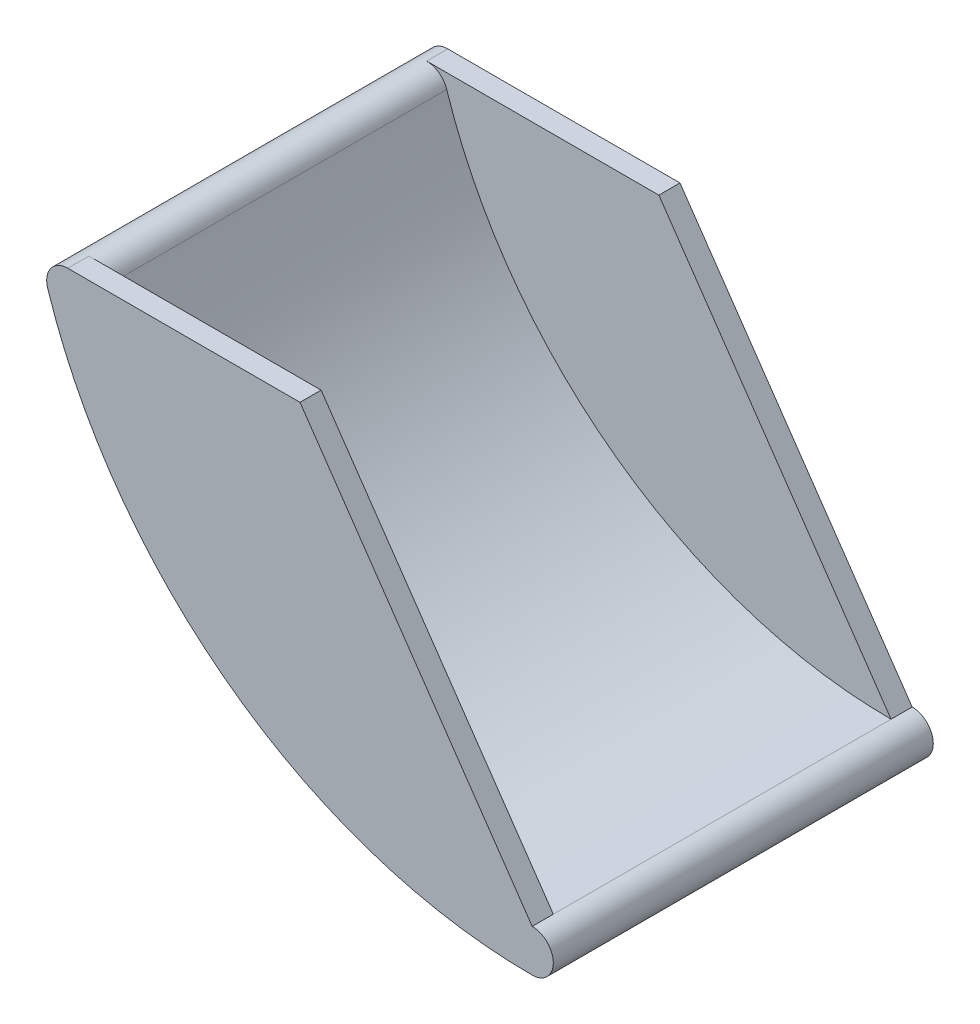
ISO-10303-21;
HEADER;
FILE_DESCRIPTION(('STEP AP214'),'2;1');
FILE_NAME('part.step','',(''),(''),'','','');
FILE_SCHEMA(('AUTOMOTIVE_DESIGN { 1 0 10303 214 1 1 1 1 }'));
ENDSEC;
DATA;
#1=APPLICATION_CONTEXT('core data for automotive mechanical design processes');
#2=APPLICATION_PROTOCOL_DEFINITION('international standard','automotive_design',2000,#1);
#3=PRODUCT_CONTEXT('',#1,'mechanical');
#4=PRODUCT('Part','Part','',(#3));
#5=PRODUCT_RELATED_PRODUCT_CATEGORY('part','',(#4));
#6=PRODUCT_DEFINITION_FORMATION('','',#4);
#7=PRODUCT_DEFINITION_CONTEXT('part definition',#1,'design');
#8=PRODUCT_DEFINITION('design','',#6,#7);
#9=PRODUCT_DEFINITION_SHAPE('','',#8);
#10=(LENGTH_UNIT() NAMED_UNIT(*) SI_UNIT(.MILLI.,.METRE.));
#11=(NAMED_UNIT(*) PLANE_ANGLE_UNIT() SI_UNIT($,.RADIAN.));
#12=(NAMED_UNIT(*) SI_UNIT($,.STERADIAN.) SOLID_ANGLE_UNIT());
#13=UNCERTAINTY_MEASURE_WITH_UNIT(LENGTH_MEASURE(1.E-05),#10,'distance_accuracy_value','');
#14=(GEOMETRIC_REPRESENTATION_CONTEXT(3) GLOBAL_UNCERTAINTY_ASSIGNED_CONTEXT((#13)) GLOBAL_UNIT_ASSIGNED_CONTEXT((#10,
#11,#12)) REPRESENTATION_CONTEXT('',''));
#15=CARTESIAN_POINT('',(0.,0.,0.));
#16=DIRECTION('',(0.,0.,1.));
#17=DIRECTION('',(1.,0.,0.));
#18=AXIS2_PLACEMENT_3D('',#15,#16,#17);
#19=CARTESIAN_POINT('',(219.999982950901,231.249976557489,90.));
#20=DIRECTION('',(0.,0.,-1.));
#21=DIRECTION('',(-1.,0.,0.));
#22=AXIS2_PLACEMENT_3D('',#19,#20,#21);
#23=CYLINDRICAL_SURFACE('',#22,221.249976557489);
#24=DIRECTION('',(0.,0.,-1.));
#25=VECTOR('',#24,1.);
#26=CARTESIAN_POINT('',(219.999999262742,10.0000000000006,90.));
#27=LINE('',#26,#25);
#28=CARTESIAN_POINT('',(219.999999262742,10.0000000000006,80.));
#29=VERTEX_POINT('',#28);
#30=CARTESIAN_POINT('',(219.999999262742,10.0000000000006,-80.));
#31=VERTEX_POINT('',#30);
#32=EDGE_CURVE('E178',#29,#31,#27,.T.);
#33=ORIENTED_EDGE('',*,*,#32,.T.);
#34=CARTESIAN_POINT('',(219.999982950901,231.249976557489,-80.));
#35=DIRECTION('',(0.,0.,1.));
#36=DIRECTION('',(1.,0.,0.));
#37=AXIS2_PLACEMENT_3D('',#34,#35,#36);
#38=CIRCLE('',#37,221.249976557489);
#39=CARTESIAN_POINT('',(9.51351374066933,163.081080379689,-79.9999999999999));
#40=VERTEX_POINT('',#39);
#41=EDGE_CURVE('E136',#40,#31,#38,.T.);
#42=ORIENTED_EDGE('',*,*,#41,.F.);
#43=DIRECTION('',(0.,0.,-1.));
#44=VECTOR('',#43,1.);
#45=CARTESIAN_POINT('',(9.51351374066933,163.081080379689,90.));
#46=LINE('',#45,#44);
#47=CARTESIAN_POINT('',(9.51351374066916,163.081080379689,80.));
#48=VERTEX_POINT('',#47);
#49=EDGE_CURVE('E175',#48,#40,#46,.T.);
#50=ORIENTED_EDGE('',*,*,#49,.F.);
#51=CARTESIAN_POINT('',(219.999982950901,231.249976557489,80.));
#52=DIRECTION('',(0.,0.,1.));
#53=DIRECTION('',(1.,0.,0.));
#54=AXIS2_PLACEMENT_3D('',#51,#52,#53);
#55=CIRCLE('',#54,221.249976557489);
#56=EDGE_CURVE('E141',#48,#29,#55,.T.);
#57=ORIENTED_EDGE('',*,*,#56,.T.);
#58=EDGE_LOOP('',(#33,#42,#50,#57));
#59=FACE_BOUND('',#58,.T.);
#60=ADVANCED_FACE('F39',(#59),#23,.F.);
#61=CARTESIAN_POINT('',(219.999982950901,231.249976557489,90.));
#62=DIRECTION('',(0.,0.,-1.));
#63=DIRECTION('',(-1.,0.,0.));
#64=AXIS2_PLACEMENT_3D('',#61,#62,#63);
#65=CYLINDRICAL_SURFACE('',#64,241.249976557489);
#66=CARTESIAN_POINT('',(219.999982950901,231.249976557489,-90.));
#67=DIRECTION('',(0.,0.,1.));
#68=DIRECTION('',(1.,0.,0.));
#69=AXIS2_PLACEMENT_3D('',#66,#67,#68);
#70=CIRCLE('',#69,241.249976557489);
#71=CARTESIAN_POINT('',(-9.51351374066881,156.918919620311,-90.));
#72=VERTEX_POINT('',#71);
#73=CARTESIAN_POINT('',(220.000000737258,-9.99999999999995,-90.));
#74=VERTEX_POINT('',#73);
#75=EDGE_CURVE('E154',#72,#74,#70,.T.);
#76=ORIENTED_EDGE('',*,*,#75,.T.);
#77=DIRECTION('',(0.,0.,-1.));
#78=VECTOR('',#77,1.);
#79=CARTESIAN_POINT('',(220.000000737258,-9.99999999999995,90.));
#80=LINE('',#79,#78);
#81=CARTESIAN_POINT('',(220.000000737258,-9.99999999999995,90.));
#82=VERTEX_POINT('',#81);
#83=EDGE_CURVE('E47',#82,#74,#80,.T.);
#84=ORIENTED_EDGE('',*,*,#83,.F.);
#85=CARTESIAN_POINT('',(219.999982950901,231.249976557489,90.));
#86=DIRECTION('',(0.,0.,1.));
#87=DIRECTION('',(1.,0.,0.));
#88=AXIS2_PLACEMENT_3D('',#85,#86,#87);
#89=CIRCLE('',#88,241.249976557489);
#90=CARTESIAN_POINT('',(-9.51351374066881,156.918919620311,90.));
#91=VERTEX_POINT('',#90);
#92=EDGE_CURVE('E155',#91,#82,#89,.T.);
#93=ORIENTED_EDGE('',*,*,#92,.F.);
#94=DIRECTION('',(0.,0.,-1.));
#95=VECTOR('',#94,1.);
#96=CARTESIAN_POINT('',(-9.51351374066881,156.918919620311,90.));
#97=LINE('',#96,#95);
#98=EDGE_CURVE('E165',#91,#72,#97,.T.);
#99=ORIENTED_EDGE('',*,*,#98,.T.);
#100=EDGE_LOOP('',(#76,#84,#93,#99));
#101=FACE_BOUND('',#100,.T.);
#102=ADVANCED_FACE('F41',(#101),#65,.T.);
#103=CARTESIAN_POINT('',(220.,0.,90.));
#104=DIRECTION('',(0.,0.,-1.));
#105=DIRECTION('',(-1.,0.,0.));
#106=AXIS2_PLACEMENT_3D('',#103,#104,#105);
#107=CYLINDRICAL_SURFACE('',#106,10.0000000000003);
#108=CARTESIAN_POINT('',(220.,0.,-90.));
#109=DIRECTION('',(0.,0.,1.));
#110=DIRECTION('',(1.,0.,0.));
#111=AXIS2_PLACEMENT_3D('',#108,#109,#110);
#112=CIRCLE('',#111,10.0000000000003);
#113=CARTESIAN_POINT('',(219.999999262742,10.0000000000006,-90.));
#114=VERTEX_POINT('',#113);
#115=EDGE_CURVE('E168',#74,#114,#112,.T.);
#116=ORIENTED_EDGE('',*,*,#115,.T.);
#117=DIRECTION('',(0.,0.,1.));
#118=VECTOR('',#117,1.);
#119=CARTESIAN_POINT('',(219.999999262742,10.0000000000006,-90.));
#120=LINE('',#119,#118);
#121=EDGE_CURVE('E111',#114,#31,#120,.T.);
#122=ORIENTED_EDGE('',*,*,#121,.T.);
#123=ORIENTED_EDGE('',*,*,#32,.F.);
#124=CARTESIAN_POINT('',(219.999999262742,10.0000000000006,90.));
#125=VERTEX_POINT('',#124);
#126=EDGE_CURVE('E179',#125,#29,#27,.T.);
#127=ORIENTED_EDGE('',*,*,#126,.F.);
#128=CARTESIAN_POINT('',(220.,0.,90.));
#129=DIRECTION('',(0.,0.,1.));
#130=DIRECTION('',(1.,0.,0.));
#131=AXIS2_PLACEMENT_3D('',#128,#129,#130);
#132=CIRCLE('',#131,10.0000000000003);
#133=EDGE_CURVE('E158',#82,#125,#132,.T.);
#134=ORIENTED_EDGE('',*,*,#133,.F.);
#135=ORIENTED_EDGE('',*,*,#83,.T.);
#136=EDGE_LOOP('',(#116,#122,#123,#127,#134,#135));
#137=FACE_BOUND('',#136,.T.);
#138=ADVANCED_FACE('F183',(#137),#107,.T.);
#139=CARTESIAN_POINT('',(0.,160.,90.));
#140=DIRECTION('',(0.,0.,-1.));
#141=DIRECTION('',(-1.,0.,0.));
#142=AXIS2_PLACEMENT_3D('',#139,#140,#141);
#143=CYLINDRICAL_SURFACE('',#142,10.0000000000003);
#144=CARTESIAN_POINT('',(0.,160.,-80.));
#145=DIRECTION('',(0.,0.,-1.));
#146=DIRECTION('',(1.,0.,0.));
#147=AXIS2_PLACEMENT_3D('',#144,#145,#146);
#148=CIRCLE('',#147,10.0000000000005);
#149=CARTESIAN_POINT('',(0.,170.,-80.));
#150=VERTEX_POINT('',#149);
#151=EDGE_CURVE('E132',#150,#40,#148,.T.);
#152=ORIENTED_EDGE('',*,*,#151,.F.);
#153=DIRECTION('',(0.,0.,1.));
#154=VECTOR('',#153,1.);
#155=CARTESIAN_POINT('',(-1.18181540235319E-13,170.,-90.));
#156=LINE('',#155,#154);
#157=CARTESIAN_POINT('',(-1.18181540235319E-13,170.,-90.));
#158=VERTEX_POINT('',#157);
#159=EDGE_CURVE('E130',#158,#150,#156,.T.);
#160=ORIENTED_EDGE('',*,*,#159,.F.);
#161=CARTESIAN_POINT('',(0.,160.,-90.));
#162=DIRECTION('',(0.,0.,1.));
#163=DIRECTION('',(1.,0.,0.));
#164=AXIS2_PLACEMENT_3D('',#161,#162,#163);
#165=CIRCLE('',#164,10.0000000000003);
#166=EDGE_CURVE('E127',#158,#72,#165,.T.);
#167=ORIENTED_EDGE('',*,*,#166,.T.);
#168=ORIENTED_EDGE('',*,*,#98,.F.);
#169=CARTESIAN_POINT('',(0.,160.,90.));
#170=DIRECTION('',(0.,0.,1.));
#171=DIRECTION('',(1.,0.,0.));
#172=AXIS2_PLACEMENT_3D('',#169,#170,#171);
#173=CIRCLE('',#172,10.0000000000003);
#174=CARTESIAN_POINT('',(-1.18181540235319E-13,170.,90.));
#175=VERTEX_POINT('',#174);
#176=EDGE_CURVE('E163',#175,#91,#173,.T.);
#177=ORIENTED_EDGE('',*,*,#176,.F.);
#178=DIRECTION('',(0.,0.,-1.));
#179=VECTOR('',#178,1.);
#180=CARTESIAN_POINT('',(-1.18181540235319E-13,170.,90.));
#181=LINE('',#180,#179);
#182=CARTESIAN_POINT('',(-1.18181540235319E-13,170.,80.));
#183=VERTEX_POINT('',#182);
#184=EDGE_CURVE('E144',#175,#183,#181,.T.);
#185=ORIENTED_EDGE('',*,*,#184,.T.);
#186=CARTESIAN_POINT('',(0.,160.,80.));
#187=DIRECTION('',(0.,0.,-1.));
#188=DIRECTION('',(1.,0.,0.));
#189=AXIS2_PLACEMENT_3D('',#186,#187,#188);
#190=CIRCLE('',#189,10.0000000000005);
#191=EDGE_CURVE('E145',#183,#48,#190,.T.);
#192=ORIENTED_EDGE('',*,*,#191,.T.);
#193=ORIENTED_EDGE('',*,*,#49,.T.);
#194=EDGE_LOOP('',(#152,#160,#167,#168,#177,#185,#192,#193));
#195=FACE_BOUND('',#194,.T.);
#196=ADVANCED_FACE('F190',(#195),#143,.T.);
#197=CARTESIAN_POINT('',(0.,0.,90.));
#198=DIRECTION('',(0.,0.,1.));
#199=DIRECTION('',(1.,0.,0.));
#200=AXIS2_PLACEMENT_3D('',#197,#198,#199);
#201=PLANE('',#200);
#202=DIRECTION('',(0.566528821597874,-0.824041925085687,0.));
#203=VECTOR('',#202,1.);
#204=CARTESIAN_POINT('',(219.999999262742,10.0000000000006,90.));
#205=LINE('',#204,#203);
#206=CARTESIAN_POINT('',(109.999999631371,170.,90.));
#207=VERTEX_POINT('',#206);
#208=EDGE_CURVE('E116',#207,#125,#205,.T.);
#209=ORIENTED_EDGE('',*,*,#208,.F.);
#210=DIRECTION('',(-1.,0.,0.));
#211=VECTOR('',#210,1.);
#212=CARTESIAN_POINT('',(-1.18181540235319E-13,170.,90.));
#213=LINE('',#212,#211);
#214=EDGE_CURVE('E142',#207,#175,#213,.T.);
#215=ORIENTED_EDGE('',*,*,#214,.T.);
#216=ORIENTED_EDGE('',*,*,#176,.T.);
#217=ORIENTED_EDGE('',*,*,#92,.T.);
#218=ORIENTED_EDGE('',*,*,#133,.T.);
#219=EDGE_LOOP('',(#209,#215,#216,#217,#218));
#220=FACE_BOUND('',#219,.T.);
#221=ADVANCED_FACE('F211',(#220),#201,.T.);
#222=CARTESIAN_POINT('',(0.,0.,-90.));
#223=DIRECTION('',(0.,0.,1.));
#224=DIRECTION('',(1.,0.,0.));
#225=AXIS2_PLACEMENT_3D('',#222,#223,#224);
#226=PLANE('',#225);
#227=DIRECTION('',(-1.,0.,0.));
#228=VECTOR('',#227,1.);
#229=CARTESIAN_POINT('',(-1.18181540235319E-13,170.,-90.));
#230=LINE('',#229,#228);
#231=CARTESIAN_POINT('',(109.999999631371,170.,-90.));
#232=VERTEX_POINT('',#231);
#233=EDGE_CURVE('E121',#232,#158,#230,.T.);
#234=ORIENTED_EDGE('',*,*,#233,.F.);
#235=DIRECTION('',(0.566528821597874,-0.824041925085687,0.));
#236=VECTOR('',#235,1.);
#237=CARTESIAN_POINT('',(219.999999262742,10.0000000000006,-90.));
#238=LINE('',#237,#236);
#239=EDGE_CURVE('E108',#232,#114,#238,.T.);
#240=ORIENTED_EDGE('',*,*,#239,.T.);
#241=ORIENTED_EDGE('',*,*,#115,.F.);
#242=ORIENTED_EDGE('',*,*,#75,.F.);
#243=ORIENTED_EDGE('',*,*,#166,.F.);
#244=EDGE_LOOP('',(#234,#240,#241,#242,#243));
#245=FACE_BOUND('',#244,.T.);
#246=ADVANCED_FACE('F125',(#245),#226,.F.);
#247=CARTESIAN_POINT('',(-1.18181540235319E-13,170.,90.));
#248=DIRECTION('',(0.,-1.,0.));
#249=DIRECTION('',(0.,0.,-1.));
#250=AXIS2_PLACEMENT_3D('',#247,#248,#249);
#251=PLANE('',#250);
#252=ORIENTED_EDGE('',*,*,#214,.F.);
#253=DIRECTION('',(0.,0.,1.));
#254=VECTOR('',#253,1.);
#255=CARTESIAN_POINT('',(109.999999631371,170.,-90.));
#256=LINE('',#255,#254);
#257=CARTESIAN_POINT('',(109.999999631371,170.,79.9999999999999));
#258=VERTEX_POINT('',#257);
#259=EDGE_CURVE('E115',#258,#207,#256,.T.);
#260=ORIENTED_EDGE('',*,*,#259,.F.);
#261=DIRECTION('',(-1.,0.,0.));
#262=VECTOR('',#261,1.);
#263=CARTESIAN_POINT('',(-1.18181540235319E-13,170.,80.));
#264=LINE('',#263,#262);
#265=EDGE_CURVE('E148',#258,#183,#264,.T.);
#266=ORIENTED_EDGE('',*,*,#265,.T.);
#267=ORIENTED_EDGE('',*,*,#184,.F.);
#268=EDGE_LOOP('',(#252,#260,#266,#267));
#269=FACE_BOUND('',#268,.T.);
#270=ADVANCED_FACE('F208',(#269),#251,.F.);
#271=CARTESIAN_POINT('',(219.999982950901,231.249976557489,80.));
#272=DIRECTION('',(0.,0.,1.));
#273=DIRECTION('',(1.,0.,0.));
#274=AXIS2_PLACEMENT_3D('',#271,#272,#273);
#275=PLANE('',#274);
#276=ORIENTED_EDGE('',*,*,#265,.F.);
#277=DIRECTION('',(0.566528821597874,-0.824041925085687,0.));
#278=VECTOR('',#277,1.);
#279=CARTESIAN_POINT('',(116.710880426875,160.238718810192,80.));
#280=LINE('',#279,#278);
#281=EDGE_CURVE('E123',#258,#29,#280,.T.);
#282=ORIENTED_EDGE('',*,*,#281,.T.);
#283=ORIENTED_EDGE('',*,*,#56,.F.);
#284=ORIENTED_EDGE('',*,*,#191,.F.);
#285=EDGE_LOOP('',(#276,#282,#283,#284));
#286=FACE_BOUND('',#285,.T.);
#287=ADVANCED_FACE('F203',(#286),#275,.F.);
#288=CARTESIAN_POINT('',(-1.18181540235319E-13,170.,-90.));
#289=DIRECTION('',(0.,1.,0.));
#290=DIRECTION('',(0.,0.,1.));
#291=AXIS2_PLACEMENT_3D('',#288,#289,#290);
#292=PLANE('',#291);
#293=CARTESIAN_POINT('',(109.999999631371,170.,-80.));
#294=VERTEX_POINT('',#293);
#295=EDGE_CURVE('E54',#232,#294,#256,.T.);
#296=ORIENTED_EDGE('',*,*,#295,.F.);
#297=ORIENTED_EDGE('',*,*,#233,.T.);
#298=ORIENTED_EDGE('',*,*,#159,.T.);
#299=DIRECTION('',(-1.,0.,0.));
#300=VECTOR('',#299,1.);
#301=CARTESIAN_POINT('',(-1.18181540235319E-13,170.,-80.));
#302=LINE('',#301,#300);
#303=EDGE_CURVE('E60',#294,#150,#302,.T.);
#304=ORIENTED_EDGE('',*,*,#303,.F.);
#305=EDGE_LOOP('',(#296,#297,#298,#304));
#306=FACE_BOUND('',#305,.T.);
#307=ADVANCED_FACE('F119',(#306),#292,.T.);
#308=CARTESIAN_POINT('',(219.999982950901,231.249976557489,-80.));
#309=DIRECTION('',(0.,0.,-1.));
#310=DIRECTION('',(1.,0.,0.));
#311=AXIS2_PLACEMENT_3D('',#308,#309,#310);
#312=PLANE('',#311);
#313=ORIENTED_EDGE('',*,*,#41,.T.);
#314=DIRECTION('',(-0.566528821597874,0.824041925085687,0.));
#315=VECTOR('',#314,1.);
#316=CARTESIAN_POINT('',(116.710880426875,160.238718810192,-80.));
#317=LINE('',#316,#315);
#318=EDGE_CURVE('E11',#31,#294,#317,.T.);
#319=ORIENTED_EDGE('',*,*,#318,.T.);
#320=ORIENTED_EDGE('',*,*,#303,.T.);
#321=ORIENTED_EDGE('',*,*,#151,.T.);
#322=EDGE_LOOP('',(#313,#319,#320,#321));
#323=FACE_BOUND('',#322,.T.);
#324=ADVANCED_FACE('F192',(#323),#312,.F.);
#325=CARTESIAN_POINT('',(219.999999262742,10.0000000000006,-90.));
#326=DIRECTION('',(-0.824041925085687,-0.566528821597874,0.));
#327=DIRECTION('',(0.566528821597874,-0.824041925085687,0.));
#328=AXIS2_PLACEMENT_3D('',#325,#326,#327);
#329=PLANE('',#328);
#330=ORIENTED_EDGE('',*,*,#121,.F.);
#331=ORIENTED_EDGE('',*,*,#239,.F.);
#332=ORIENTED_EDGE('',*,*,#295,.T.);
#333=ORIENTED_EDGE('',*,*,#318,.F.);
#334=EDGE_LOOP('',(#330,#331,#332,#333));
#335=FACE_BOUND('',#334,.T.);
#336=ADVANCED_FACE('F109',(#335),#329,.F.);
#337=ORIENTED_EDGE('',*,*,#259,.T.);
#338=ORIENTED_EDGE('',*,*,#208,.T.);
#339=ORIENTED_EDGE('',*,*,#126,.T.);
#340=ORIENTED_EDGE('',*,*,#281,.F.);
#341=EDGE_LOOP('',(#337,#338,#339,#340));
#342=FACE_BOUND('',#341,.T.);
#343=ADVANCED_FACE('F198',(#342),#329,.F.);
#344=CLOSED_SHELL('',(#60,#102,#138,#196,#221,#246,#270,#287,#307,#324,#336,#343));
#345=MANIFOLD_SOLID_BREP('B2',#344);
#346=ADVANCED_BREP_SHAPE_REPRESENTATION('',(#18,#345),#14);
#347=SHAPE_DEFINITION_REPRESENTATION(#9,#346);
ENDSEC;
END-ISO-10303-21;
